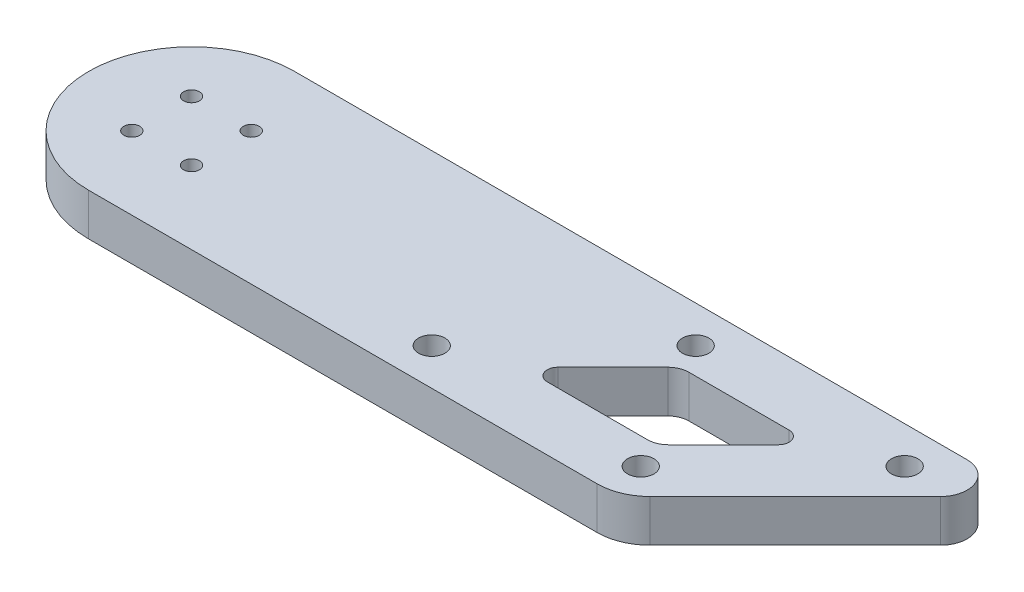
ISO-10303-21;
HEADER;
FILE_DESCRIPTION(('STEP AP214'),'2;1');
FILE_NAME('part.step','',(''),(''),'','','');
FILE_SCHEMA(('AUTOMOTIVE_DESIGN { 1 0 10303 214 1 1 1 1 }'));
ENDSEC;
DATA;
#1=APPLICATION_CONTEXT('core data for automotive mechanical design processes');
#2=APPLICATION_PROTOCOL_DEFINITION('international standard','automotive_design',2000,#1);
#3=PRODUCT_CONTEXT('',#1,'mechanical');
#4=PRODUCT('Part','Part','',(#3));
#5=PRODUCT_RELATED_PRODUCT_CATEGORY('part','',(#4));
#6=PRODUCT_DEFINITION_FORMATION('','',#4);
#7=PRODUCT_DEFINITION_CONTEXT('part definition',#1,'design');
#8=PRODUCT_DEFINITION('design','',#6,#7);
#9=PRODUCT_DEFINITION_SHAPE('','',#8);
#10=(LENGTH_UNIT() NAMED_UNIT(*) SI_UNIT(.MILLI.,.METRE.));
#11=(NAMED_UNIT(*) PLANE_ANGLE_UNIT() SI_UNIT($,.RADIAN.));
#12=(NAMED_UNIT(*) SI_UNIT($,.STERADIAN.) SOLID_ANGLE_UNIT());
#13=UNCERTAINTY_MEASURE_WITH_UNIT(LENGTH_MEASURE(1.E-05),#10,'distance_accuracy_value','');
#14=(GEOMETRIC_REPRESENTATION_CONTEXT(3) GLOBAL_UNCERTAINTY_ASSIGNED_CONTEXT((#13)) GLOBAL_UNIT_ASSIGNED_CONTEXT((#10,
#11,#12)) REPRESENTATION_CONTEXT('',''));
#15=CARTESIAN_POINT('',(0.,0.,0.));
#16=DIRECTION('',(0.,0.,1.));
#17=DIRECTION('',(1.,0.,0.));
#18=AXIS2_PLACEMENT_3D('',#15,#16,#17);
#19=CARTESIAN_POINT('',(0.,8.,0.));
#20=DIRECTION('',(0.,1.,0.));
#21=DIRECTION('',(0.,0.,1.));
#22=AXIS2_PLACEMENT_3D('',#19,#20,#21);
#23=PLANE('',#22);
#24=CARTESIAN_POINT('',(58.0025253169538,8.,12.5000000000058));
#25=DIRECTION('',(0.,1.,0.));
#26=DIRECTION('',(0.,0.,1.));
#27=AXIS2_PLACEMENT_3D('',#24,#25,#26);
#28=CIRCLE('',#27,2.5);
#29=CARTESIAN_POINT('',(58.0025253169538,8.,15.0000000000058));
#30=VERTEX_POINT('',#29);
#31=EDGE_CURVE('E465',#30,#30,#28,.T.);
#32=ORIENTED_EDGE('',*,*,#31,.F.);
#33=EDGE_LOOP('',(#32));
#34=FACE_BOUND('',#33,.T.);
#35=CARTESIAN_POINT('',(83.0025253169536,8.,-12.4999999999941));
#36=DIRECTION('',(0.,1.,0.));
#37=DIRECTION('',(0.,0.,1.));
#38=AXIS2_PLACEMENT_3D('',#35,#36,#37);
#39=CIRCLE('',#38,2.50000000000001);
#40=CARTESIAN_POINT('',(83.0025253169536,8.,-9.99999999999412));
#41=VERTEX_POINT('',#40);
#42=EDGE_CURVE('E486',#41,#41,#39,.T.);
#43=ORIENTED_EDGE('',*,*,#42,.F.);
#44=EDGE_LOOP('',(#43));
#45=FACE_BOUND('',#44,.T.);
#46=CARTESIAN_POINT('',(97.6005050634004,8.,12.5000000000057));
#47=DIRECTION('',(0.,1.,0.));
#48=DIRECTION('',(0.,0.,1.));
#49=AXIS2_PLACEMENT_3D('',#46,#47,#48);
#50=CIRCLE('',#49,2.50000000000001);
#51=CARTESIAN_POINT('',(97.6005050634004,8.,15.0000000000057));
#52=VERTEX_POINT('',#51);
#53=EDGE_CURVE('E473',#52,#52,#50,.T.);
#54=ORIENTED_EDGE('',*,*,#53,.F.);
#55=EDGE_LOOP('',(#54));
#56=FACE_BOUND('',#55,.T.);
#57=CARTESIAN_POINT('',(122.6005050634,8.,-12.4999999999942));
#58=DIRECTION('',(0.,1.,0.));
#59=DIRECTION('',(0.,0.,1.));
#60=AXIS2_PLACEMENT_3D('',#57,#58,#59);
#61=CIRCLE('',#60,2.49999999999999);
#62=CARTESIAN_POINT('',(122.6005050634,8.,-9.99999999999419));
#63=VERTEX_POINT('',#62);
#64=EDGE_CURVE('E469',#63,#63,#61,.T.);
#65=ORIENTED_EDGE('',*,*,#64,.F.);
#66=EDGE_LOOP('',(#65));
#67=FACE_BOUND('',#66,.T.);
#68=CARTESIAN_POINT('',(74.9020202535654,8.,5.50000000000585));
#69=DIRECTION('',(0.,1.,0.));
#70=DIRECTION('',(0.,0.,1.));
#71=AXIS2_PLACEMENT_3D('',#68,#69,#70);
#72=CIRCLE('',#71,2.);
#73=CARTESIAN_POINT('',(73.4878066911923,8.,4.08578643763276));
#74=VERTEX_POINT('',#73);
#75=CARTESIAN_POINT('',(74.9020202535654,8.,7.50000000000585));
#76=VERTEX_POINT('',#75);
#77=EDGE_CURVE('E39',#74,#76,#72,.T.);
#78=ORIENTED_EDGE('',*,*,#77,.F.);
#79=DIRECTION('',(-0.707106781186546,0.,0.707106781186549));
#80=VECTOR('',#79,1.);
#81=CARTESIAN_POINT('',(73.4878066911923,8.,4.08578643763276));
#82=LINE('',#81,#80);
#83=CARTESIAN_POINT('',(83.9020202535653,8.,-6.32842712474034));
#84=VERTEX_POINT('',#83);
#85=EDGE_CURVE('E94',#84,#74,#82,.T.);
#86=ORIENTED_EDGE('',*,*,#85,.F.);
#87=CARTESIAN_POINT('',(86.7304473783115,8.,-3.49999999999426));
#88=DIRECTION('',(0.,1.,0.));
#89=DIRECTION('',(0.,0.,1.));
#90=AXIS2_PLACEMENT_3D('',#87,#88,#89);
#91=CIRCLE('',#90,3.99999999999988);
#92=CARTESIAN_POINT('',(86.7304473783115,8.,-7.49999999999414));
#93=VERTEX_POINT('',#92);
#94=EDGE_CURVE('E195',#93,#84,#91,.T.);
#95=ORIENTED_EDGE('',*,*,#94,.F.);
#96=DIRECTION('',(-1.,0.,0.));
#97=VECTOR('',#96,1.);
#98=CARTESIAN_POINT('',(86.7304473783115,8.,-7.49999999999414));
#99=LINE('',#98,#97);
#100=CARTESIAN_POINT('',(105.701010126789,8.,-7.49999999999415));
#101=VERTEX_POINT('',#100);
#102=EDGE_CURVE('E193',#101,#93,#99,.T.);
#103=ORIENTED_EDGE('',*,*,#102,.F.);
#104=CARTESIAN_POINT('',(105.701010126789,8.,-5.49999999999414));
#105=DIRECTION('',(0.,1.,0.));
#106=DIRECTION('',(0.,0.,1.));
#107=AXIS2_PLACEMENT_3D('',#104,#105,#106);
#108=CIRCLE('',#107,2.00000000000001);
#109=CARTESIAN_POINT('',(107.115223689162,8.,-4.08578643762105));
#110=VERTEX_POINT('',#109);
#111=EDGE_CURVE('E191',#110,#101,#108,.T.);
#112=ORIENTED_EDGE('',*,*,#111,.F.);
#113=DIRECTION('',(0.707106781186547,0.,-0.707106781186548));
#114=VECTOR('',#113,1.);
#115=CARTESIAN_POINT('',(107.115223689162,8.,-4.08578643762105));
#116=LINE('',#115,#114);
#117=CARTESIAN_POINT('',(96.7010101267887,8.,6.32842712475201));
#118=VERTEX_POINT('',#117);
#119=EDGE_CURVE('E189',#118,#110,#116,.T.);
#120=ORIENTED_EDGE('',*,*,#119,.F.);
#121=CARTESIAN_POINT('',(93.8725830020424,8.,3.50000000000569));
#122=DIRECTION('',(0.,1.,0.));
#123=DIRECTION('',(0.,0.,1.));
#124=AXIS2_PLACEMENT_3D('',#121,#122,#123);
#125=CIRCLE('',#124,4.00000000000015);
#126=CARTESIAN_POINT('',(93.8725830020424,8.,7.50000000000585));
#127=VERTEX_POINT('',#126);
#128=EDGE_CURVE('E186',#127,#118,#125,.T.);
#129=ORIENTED_EDGE('',*,*,#128,.F.);
#130=DIRECTION('',(1.,0.,0.));
#131=VECTOR('',#130,1.);
#132=CARTESIAN_POINT('',(93.8725830020425,8.,7.50000000000585));
#133=LINE('',#132,#131);
#134=EDGE_CURVE('E184',#76,#127,#133,.T.);
#135=ORIENTED_EDGE('',*,*,#134,.F.);
#136=EDGE_LOOP('',(#78,#86,#95,#103,#112,#120,#129,#135));
#137=FACE_BOUND('',#136,.T.);
#138=CARTESIAN_POINT('',(5.65685424949238,8.,5.65685424949238));
#139=DIRECTION('',(0.,1.,0.));
#140=DIRECTION('',(0.,0.,1.));
#141=AXIS2_PLACEMENT_3D('',#138,#139,#140);
#142=CIRCLE('',#141,1.5);
#143=CARTESIAN_POINT('',(5.65685424949238,8.,7.15685424949238));
#144=VERTEX_POINT('',#143);
#145=EDGE_CURVE('E210',#144,#144,#142,.T.);
#146=ORIENTED_EDGE('',*,*,#145,.F.);
#147=EDGE_LOOP('',(#146));
#148=FACE_BOUND('',#147,.T.);
#149=CARTESIAN_POINT('',(-5.65685424949238,8.,-5.65685424949238));
#150=DIRECTION('',(0.,1.,0.));
#151=DIRECTION('',(0.,0.,1.));
#152=AXIS2_PLACEMENT_3D('',#149,#150,#151);
#153=CIRCLE('',#152,1.5);
#154=CARTESIAN_POINT('',(-5.65685424949238,8.,-4.15685424949238));
#155=VERTEX_POINT('',#154);
#156=EDGE_CURVE('E169',#155,#155,#153,.T.);
#157=ORIENTED_EDGE('',*,*,#156,.F.);
#158=EDGE_LOOP('',(#157));
#159=FACE_BOUND('',#158,.T.);
#160=CARTESIAN_POINT('',(0.,8.,0.));
#161=DIRECTION('',(0.,1.,0.));
#162=DIRECTION('',(0.,0.,1.));
#163=AXIS2_PLACEMENT_3D('',#160,#161,#162);
#164=CIRCLE('',#163,19.5);
#165=CARTESIAN_POINT('',(0.,8.,-19.5));
#166=VERTEX_POINT('',#165);
#167=CARTESIAN_POINT('',(0.,8.,19.5));
#168=VERTEX_POINT('',#167);
#169=EDGE_CURVE('E176',#166,#168,#164,.T.);
#170=ORIENTED_EDGE('',*,*,#169,.T.);
#171=DIRECTION('',(1.,0.,0.));
#172=VECTOR('',#171,1.);
#173=CARTESIAN_POINT('',(0.,8.,19.5));
#174=LINE('',#173,#172);
#175=CARTESIAN_POINT('',(96.3578643762689,8.,19.5));
#176=VERTEX_POINT('',#175);
#177=EDGE_CURVE('E133',#168,#176,#174,.T.);
#178=ORIENTED_EDGE('',*,*,#177,.T.);
#179=CARTESIAN_POINT('',(96.3578643762689,8.,9.5));
#180=DIRECTION('',(0.,1.,0.));
#181=DIRECTION('',(0.,0.,1.));
#182=AXIS2_PLACEMENT_3D('',#179,#180,#181);
#183=CIRCLE('',#182,10.);
#184=CARTESIAN_POINT('',(103.428932188134,8.,16.5710678118655));
#185=VERTEX_POINT('',#184);
#186=EDGE_CURVE('E228',#176,#185,#183,.T.);
#187=ORIENTED_EDGE('',*,*,#186,.T.);
#188=DIRECTION('',(0.707106781186551,0.,-0.707106781186544));
#189=VECTOR('',#188,1.);
#190=CARTESIAN_POINT('',(130.964466094067,8.,-10.9644660940672));
#191=LINE('',#190,#189);
#192=CARTESIAN_POINT('',(130.964466094067,8.,-10.9644660940672));
#193=VERTEX_POINT('',#192);
#194=EDGE_CURVE('E152',#185,#193,#191,.T.);
#195=ORIENTED_EDGE('',*,*,#194,.T.);
#196=CARTESIAN_POINT('',(127.428932188135,8.,-14.5));
#197=DIRECTION('',(0.,1.,0.));
#198=DIRECTION('',(0.,0.,-1.));
#199=AXIS2_PLACEMENT_3D('',#196,#197,#198);
#200=CIRCLE('',#199,5.);
#201=CARTESIAN_POINT('',(127.428932188135,8.,-19.5));
#202=VERTEX_POINT('',#201);
#203=EDGE_CURVE('E147',#193,#202,#200,.T.);
#204=ORIENTED_EDGE('',*,*,#203,.T.);
#205=DIRECTION('',(-1.,0.,0.));
#206=VECTOR('',#205,1.);
#207=CARTESIAN_POINT('',(0.,8.,-19.5));
#208=LINE('',#207,#206);
#209=EDGE_CURVE('E150',#202,#166,#208,.T.);
#210=ORIENTED_EDGE('',*,*,#209,.T.);
#211=EDGE_LOOP('',(#170,#178,#187,#195,#204,#210));
#212=FACE_BOUND('',#211,.T.);
#213=CARTESIAN_POINT('',(5.65685424949238,8.,-5.65685424949238));
#214=DIRECTION('',(0.,1.,0.));
#215=DIRECTION('',(0.,0.,1.));
#216=AXIS2_PLACEMENT_3D('',#213,#214,#215);
#217=CIRCLE('',#216,1.5);
#218=CARTESIAN_POINT('',(5.65685424949238,8.,-4.15685424949238));
#219=VERTEX_POINT('',#218);
#220=EDGE_CURVE('E216',#219,#219,#217,.T.);
#221=ORIENTED_EDGE('',*,*,#220,.F.);
#222=EDGE_LOOP('',(#221));
#223=FACE_BOUND('',#222,.T.);
#224=CARTESIAN_POINT('',(-5.65685424949238,8.,5.65685424949238));
#225=DIRECTION('',(0.,1.,0.));
#226=DIRECTION('',(0.,0.,1.));
#227=AXIS2_PLACEMENT_3D('',#224,#225,#226);
#228=CIRCLE('',#227,1.5);
#229=CARTESIAN_POINT('',(-5.65685424949238,8.,7.15685424949238));
#230=VERTEX_POINT('',#229);
#231=EDGE_CURVE('E201',#230,#230,#228,.T.);
#232=ORIENTED_EDGE('',*,*,#231,.F.);
#233=EDGE_LOOP('',(#232));
#234=FACE_BOUND('',#233,.T.);
#235=ADVANCED_FACE('F35',(#34,#45,#56,#67,#137,#148,#159,#212,#223,#234),#23,.T.);
#236=CARTESIAN_POINT('',(0.,0.,0.));
#237=DIRECTION('',(0.,1.,0.));
#238=DIRECTION('',(0.,0.,1.));
#239=AXIS2_PLACEMENT_3D('',#236,#237,#238);
#240=PLANE('',#239);
#241=CARTESIAN_POINT('',(58.0025253169538,0.,12.5000000000058));
#242=DIRECTION('',(0.,1.,0.));
#243=DIRECTION('',(0.,0.,1.));
#244=AXIS2_PLACEMENT_3D('',#241,#242,#243);
#245=CIRCLE('',#244,2.5);
#246=CARTESIAN_POINT('',(58.0025253169538,0.,15.0000000000058));
#247=VERTEX_POINT('',#246);
#248=EDGE_CURVE('E468',#247,#247,#245,.T.);
#249=ORIENTED_EDGE('',*,*,#248,.T.);
#250=EDGE_LOOP('',(#249));
#251=FACE_BOUND('',#250,.T.);
#252=CARTESIAN_POINT('',(83.0025253169536,0.,-12.4999999999941));
#253=DIRECTION('',(0.,1.,0.));
#254=DIRECTION('',(0.,0.,1.));
#255=AXIS2_PLACEMENT_3D('',#252,#253,#254);
#256=CIRCLE('',#255,2.50000000000001);
#257=CARTESIAN_POINT('',(83.0025253169536,0.,-9.99999999999412));
#258=VERTEX_POINT('',#257);
#259=EDGE_CURVE('E470',#258,#258,#256,.T.);
#260=ORIENTED_EDGE('',*,*,#259,.T.);
#261=EDGE_LOOP('',(#260));
#262=FACE_BOUND('',#261,.T.);
#263=CARTESIAN_POINT('',(97.6005050634004,0.,12.5000000000057));
#264=DIRECTION('',(0.,1.,0.));
#265=DIRECTION('',(0.,0.,1.));
#266=AXIS2_PLACEMENT_3D('',#263,#264,#265);
#267=CIRCLE('',#266,2.50000000000001);
#268=CARTESIAN_POINT('',(97.6005050634004,0.,15.0000000000057));
#269=VERTEX_POINT('',#268);
#270=EDGE_CURVE('E476',#269,#269,#267,.T.);
#271=ORIENTED_EDGE('',*,*,#270,.T.);
#272=EDGE_LOOP('',(#271));
#273=FACE_BOUND('',#272,.T.);
#274=CARTESIAN_POINT('',(122.6005050634,0.,-12.4999999999942));
#275=DIRECTION('',(0.,1.,0.));
#276=DIRECTION('',(0.,0.,1.));
#277=AXIS2_PLACEMENT_3D('',#274,#275,#276);
#278=CIRCLE('',#277,2.49999999999999);
#279=CARTESIAN_POINT('',(122.6005050634,0.,-9.99999999999419));
#280=VERTEX_POINT('',#279);
#281=EDGE_CURVE('E481',#280,#280,#278,.T.);
#282=ORIENTED_EDGE('',*,*,#281,.T.);
#283=EDGE_LOOP('',(#282));
#284=FACE_BOUND('',#283,.T.);
#285=DIRECTION('',(-0.707106781186546,0.,0.707106781186549));
#286=VECTOR('',#285,1.);
#287=CARTESIAN_POINT('',(73.4878066911923,0.,4.08578643763276));
#288=LINE('',#287,#286);
#289=CARTESIAN_POINT('',(83.9020202535653,0.,-6.32842712474032));
#290=VERTEX_POINT('',#289);
#291=CARTESIAN_POINT('',(73.4878066911923,0.,4.08578643763276));
#292=VERTEX_POINT('',#291);
#293=EDGE_CURVE('E509',#290,#292,#288,.T.);
#294=ORIENTED_EDGE('',*,*,#293,.T.);
#295=CARTESIAN_POINT('',(74.9020202535654,0.,5.50000000000585));
#296=DIRECTION('',(0.,1.,0.));
#297=DIRECTION('',(0.,0.,-1.));
#298=AXIS2_PLACEMENT_3D('',#295,#296,#297);
#299=CIRCLE('',#298,2.);
#300=CARTESIAN_POINT('',(74.9020202535654,0.,7.50000000000585));
#301=VERTEX_POINT('',#300);
#302=EDGE_CURVE('E490',#292,#301,#299,.T.);
#303=ORIENTED_EDGE('',*,*,#302,.T.);
#304=DIRECTION('',(1.,0.,0.));
#305=VECTOR('',#304,1.);
#306=CARTESIAN_POINT('',(93.8725830020425,0.,7.50000000000585));
#307=LINE('',#306,#305);
#308=CARTESIAN_POINT('',(93.8725830020425,0.,7.50000000000585));
#309=VERTEX_POINT('',#308);
#310=EDGE_CURVE('E493',#301,#309,#307,.T.);
#311=ORIENTED_EDGE('',*,*,#310,.T.);
#312=CARTESIAN_POINT('',(93.8725830020424,0.,3.50000000000569));
#313=DIRECTION('',(0.,1.,0.));
#314=DIRECTION('',(0.,0.,1.));
#315=AXIS2_PLACEMENT_3D('',#312,#313,#314);
#316=CIRCLE('',#315,4.00000000000015);
#317=CARTESIAN_POINT('',(96.7010101267887,0.,6.32842712475204));
#318=VERTEX_POINT('',#317);
#319=EDGE_CURVE('E61',#309,#318,#316,.T.);
#320=ORIENTED_EDGE('',*,*,#319,.T.);
#321=DIRECTION('',(0.707106781186547,0.,-0.707106781186548));
#322=VECTOR('',#321,1.);
#323=CARTESIAN_POINT('',(107.115223689162,0.,-4.08578643762105));
#324=LINE('',#323,#322);
#325=CARTESIAN_POINT('',(107.115223689162,0.,-4.08578643762105));
#326=VERTEX_POINT('',#325);
#327=EDGE_CURVE('E497',#318,#326,#324,.T.);
#328=ORIENTED_EDGE('',*,*,#327,.T.);
#329=CARTESIAN_POINT('',(105.701010126789,0.,-5.49999999999414));
#330=DIRECTION('',(0.,1.,0.));
#331=DIRECTION('',(0.,0.,1.));
#332=AXIS2_PLACEMENT_3D('',#329,#330,#331);
#333=CIRCLE('',#332,2.00000000000001);
#334=CARTESIAN_POINT('',(105.701010126789,0.,-7.49999999999415));
#335=VERTEX_POINT('',#334);
#336=EDGE_CURVE('E500',#326,#335,#333,.T.);
#337=ORIENTED_EDGE('',*,*,#336,.T.);
#338=DIRECTION('',(-1.,0.,0.));
#339=VECTOR('',#338,1.);
#340=CARTESIAN_POINT('',(86.7304473783115,0.,-7.49999999999414));
#341=LINE('',#340,#339);
#342=CARTESIAN_POINT('',(86.7304473783115,0.,-7.49999999999414));
#343=VERTEX_POINT('',#342);
#344=EDGE_CURVE('E503',#335,#343,#341,.T.);
#345=ORIENTED_EDGE('',*,*,#344,.T.);
#346=CARTESIAN_POINT('',(86.7304473783115,0.,-3.49999999999426));
#347=DIRECTION('',(0.,1.,0.));
#348=DIRECTION('',(0.,0.,1.));
#349=AXIS2_PLACEMENT_3D('',#346,#347,#348);
#350=CIRCLE('',#349,3.99999999999988);
#351=EDGE_CURVE('E506',#343,#290,#350,.T.);
#352=ORIENTED_EDGE('',*,*,#351,.T.);
#353=EDGE_LOOP('',(#294,#303,#311,#320,#328,#337,#345,#352));
#354=FACE_BOUND('',#353,.T.);
#355=CARTESIAN_POINT('',(0.,0.,0.));
#356=DIRECTION('',(0.,1.,0.));
#357=DIRECTION('',(0.,0.,1.));
#358=AXIS2_PLACEMENT_3D('',#355,#356,#357);
#359=CIRCLE('',#358,19.5);
#360=CARTESIAN_POINT('',(0.,0.,-19.5));
#361=VERTEX_POINT('',#360);
#362=CARTESIAN_POINT('',(0.,0.,19.5));
#363=VERTEX_POINT('',#362);
#364=EDGE_CURVE('E166',#361,#363,#359,.T.);
#365=ORIENTED_EDGE('',*,*,#364,.F.);
#366=DIRECTION('',(-1.,0.,0.));
#367=VECTOR('',#366,1.);
#368=CARTESIAN_POINT('',(0.,0.,-19.5));
#369=LINE('',#368,#367);
#370=CARTESIAN_POINT('',(127.428932188135,0.,-19.5));
#371=VERTEX_POINT('',#370);
#372=EDGE_CURVE('E125',#371,#361,#369,.T.);
#373=ORIENTED_EDGE('',*,*,#372,.F.);
#374=CARTESIAN_POINT('',(127.428932188135,0.,-14.5));
#375=DIRECTION('',(0.,1.,0.));
#376=DIRECTION('',(0.,0.,-1.));
#377=AXIS2_PLACEMENT_3D('',#374,#375,#376);
#378=CIRCLE('',#377,5.);
#379=CARTESIAN_POINT('',(130.964466094067,0.,-10.9644660940672));
#380=VERTEX_POINT('',#379);
#381=EDGE_CURVE('E118',#380,#371,#378,.T.);
#382=ORIENTED_EDGE('',*,*,#381,.F.);
#383=DIRECTION('',(0.707106781186551,0.,-0.707106781186544));
#384=VECTOR('',#383,1.);
#385=CARTESIAN_POINT('',(130.964466094067,0.,-10.9644660940672));
#386=LINE('',#385,#384);
#387=CARTESIAN_POINT('',(103.428932188134,0.,16.5710678118655));
#388=VERTEX_POINT('',#387);
#389=EDGE_CURVE('E173',#388,#380,#386,.T.);
#390=ORIENTED_EDGE('',*,*,#389,.F.);
#391=CARTESIAN_POINT('',(96.3578643762689,0.,9.5));
#392=DIRECTION('',(0.,1.,0.));
#393=DIRECTION('',(0.,0.,1.));
#394=AXIS2_PLACEMENT_3D('',#391,#392,#393);
#395=CIRCLE('',#394,10.);
#396=CARTESIAN_POINT('',(96.3578643762689,0.,19.5));
#397=VERTEX_POINT('',#396);
#398=EDGE_CURVE('E171',#397,#388,#395,.T.);
#399=ORIENTED_EDGE('',*,*,#398,.F.);
#400=DIRECTION('',(1.,0.,0.));
#401=VECTOR('',#400,1.);
#402=CARTESIAN_POINT('',(0.,0.,19.5));
#403=LINE('',#402,#401);
#404=EDGE_CURVE('E103',#363,#397,#403,.T.);
#405=ORIENTED_EDGE('',*,*,#404,.F.);
#406=EDGE_LOOP('',(#365,#373,#382,#390,#399,#405));
#407=FACE_BOUND('',#406,.T.);
#408=CARTESIAN_POINT('',(-5.65685424949238,0.,-5.65685424949238));
#409=DIRECTION('',(0.,1.,0.));
#410=DIRECTION('',(0.,0.,1.));
#411=AXIS2_PLACEMENT_3D('',#408,#409,#410);
#412=CIRCLE('',#411,1.5);
#413=CARTESIAN_POINT('',(-5.65685424949238,0.,-4.15685424949238));
#414=VERTEX_POINT('',#413);
#415=EDGE_CURVE('E219',#414,#414,#412,.T.);
#416=ORIENTED_EDGE('',*,*,#415,.T.);
#417=EDGE_LOOP('',(#416));
#418=FACE_BOUND('',#417,.T.);
#419=CARTESIAN_POINT('',(5.65685424949238,0.,-5.65685424949238));
#420=DIRECTION('',(0.,1.,0.));
#421=DIRECTION('',(0.,0.,1.));
#422=AXIS2_PLACEMENT_3D('',#419,#420,#421);
#423=CIRCLE('',#422,1.5);
#424=CARTESIAN_POINT('',(5.65685424949238,0.,-4.15685424949238));
#425=VERTEX_POINT('',#424);
#426=EDGE_CURVE('E213',#425,#425,#423,.T.);
#427=ORIENTED_EDGE('',*,*,#426,.T.);
#428=EDGE_LOOP('',(#427));
#429=FACE_BOUND('',#428,.T.);
#430=CARTESIAN_POINT('',(5.65685424949238,0.,5.65685424949238));
#431=DIRECTION('',(0.,1.,0.));
#432=DIRECTION('',(0.,0.,1.));
#433=AXIS2_PLACEMENT_3D('',#430,#431,#432);
#434=CIRCLE('',#433,1.5);
#435=CARTESIAN_POINT('',(5.65685424949238,0.,7.15685424949238));
#436=VERTEX_POINT('',#435);
#437=EDGE_CURVE('E206',#436,#436,#434,.T.);
#438=ORIENTED_EDGE('',*,*,#437,.T.);
#439=EDGE_LOOP('',(#438));
#440=FACE_BOUND('',#439,.T.);
#441=CARTESIAN_POINT('',(-5.65685424949238,0.,5.65685424949238));
#442=DIRECTION('',(0.,1.,0.));
#443=DIRECTION('',(0.,0.,1.));
#444=AXIS2_PLACEMENT_3D('',#441,#442,#443);
#445=CIRCLE('',#444,1.5);
#446=CARTESIAN_POINT('',(-5.65685424949238,0.,7.15685424949238));
#447=VERTEX_POINT('',#446);
#448=EDGE_CURVE('E196',#447,#447,#445,.T.);
#449=ORIENTED_EDGE('',*,*,#448,.T.);
#450=EDGE_LOOP('',(#449));
#451=FACE_BOUND('',#450,.T.);
#452=ADVANCED_FACE('F236',(#251,#262,#273,#284,#354,#407,#418,#429,#440,#451),#240,.F.);
#453=CARTESIAN_POINT('',(0.,8.,0.));
#454=DIRECTION('',(0.,-1.,0.));
#455=DIRECTION('',(0.,0.,-1.));
#456=AXIS2_PLACEMENT_3D('',#453,#454,#455);
#457=CYLINDRICAL_SURFACE('',#456,19.5);
#458=ORIENTED_EDGE('',*,*,#364,.T.);
#459=DIRECTION('',(0.,-1.,0.));
#460=VECTOR('',#459,1.);
#461=CARTESIAN_POINT('',(0.,8.,19.5));
#462=LINE('',#461,#460);
#463=EDGE_CURVE('E11',#168,#363,#462,.T.);
#464=ORIENTED_EDGE('',*,*,#463,.F.);
#465=ORIENTED_EDGE('',*,*,#169,.F.);
#466=DIRECTION('',(0.,-1.,0.));
#467=VECTOR('',#466,1.);
#468=CARTESIAN_POINT('',(0.,8.,-19.5));
#469=LINE('',#468,#467);
#470=EDGE_CURVE('E158',#166,#361,#469,.T.);
#471=ORIENTED_EDGE('',*,*,#470,.T.);
#472=EDGE_LOOP('',(#458,#464,#465,#471));
#473=FACE_BOUND('',#472,.T.);
#474=ADVANCED_FACE('F37',(#473),#457,.T.);
#475=CARTESIAN_POINT('',(0.,8.,19.5));
#476=DIRECTION('',(0.,0.,-1.));
#477=DIRECTION('',(-1.,0.,0.));
#478=AXIS2_PLACEMENT_3D('',#475,#476,#477);
#479=PLANE('',#478);
#480=ORIENTED_EDGE('',*,*,#404,.T.);
#481=DIRECTION('',(0.,-1.,0.));
#482=VECTOR('',#481,1.);
#483=CARTESIAN_POINT('',(96.3578643762689,8.,19.5));
#484=LINE('',#483,#482);
#485=EDGE_CURVE('E44',#176,#397,#484,.T.);
#486=ORIENTED_EDGE('',*,*,#485,.F.);
#487=ORIENTED_EDGE('',*,*,#177,.F.);
#488=ORIENTED_EDGE('',*,*,#463,.T.);
#489=EDGE_LOOP('',(#480,#486,#487,#488));
#490=FACE_BOUND('',#489,.T.);
#491=ADVANCED_FACE('F240',(#490),#479,.F.);
#492=CARTESIAN_POINT('',(96.3578643762689,8.,9.5));
#493=DIRECTION('',(0.,-1.,0.));
#494=DIRECTION('',(0.,0.,-1.));
#495=AXIS2_PLACEMENT_3D('',#492,#493,#494);
#496=CYLINDRICAL_SURFACE('',#495,10.);
#497=ORIENTED_EDGE('',*,*,#398,.T.);
#498=DIRECTION('',(0.,-1.,0.));
#499=VECTOR('',#498,1.);
#500=CARTESIAN_POINT('',(103.428932188134,8.,16.5710678118655));
#501=LINE('',#500,#499);
#502=EDGE_CURVE('E179',#185,#388,#501,.T.);
#503=ORIENTED_EDGE('',*,*,#502,.F.);
#504=ORIENTED_EDGE('',*,*,#186,.F.);
#505=ORIENTED_EDGE('',*,*,#485,.T.);
#506=EDGE_LOOP('',(#497,#503,#504,#505));
#507=FACE_BOUND('',#506,.T.);
#508=ADVANCED_FACE('F232',(#507),#496,.T.);
#509=CARTESIAN_POINT('',(130.964466094067,8.,-10.9644660940672));
#510=DIRECTION('',(-0.707106781186544,0.,-0.707106781186551));
#511=DIRECTION('',(-0.707106781186551,0.,0.707106781186544));
#512=AXIS2_PLACEMENT_3D('',#509,#510,#511);
#513=PLANE('',#512);
#514=ORIENTED_EDGE('',*,*,#389,.T.);
#515=DIRECTION('',(0.,-1.,0.));
#516=VECTOR('',#515,1.);
#517=CARTESIAN_POINT('',(130.964466094067,8.,-10.9644660940672));
#518=LINE('',#517,#516);
#519=EDGE_CURVE('E157',#193,#380,#518,.T.);
#520=ORIENTED_EDGE('',*,*,#519,.F.);
#521=ORIENTED_EDGE('',*,*,#194,.F.);
#522=ORIENTED_EDGE('',*,*,#502,.T.);
#523=EDGE_LOOP('',(#514,#520,#521,#522));
#524=FACE_BOUND('',#523,.T.);
#525=ADVANCED_FACE('F235',(#524),#513,.F.);
#526=CARTESIAN_POINT('',(127.428932188135,8.,-14.5));
#527=DIRECTION('',(0.,-1.,0.));
#528=DIRECTION('',(0.,0.,-1.));
#529=AXIS2_PLACEMENT_3D('',#526,#527,#528);
#530=CYLINDRICAL_SURFACE('',#529,5.);
#531=ORIENTED_EDGE('',*,*,#381,.T.);
#532=DIRECTION('',(0.,-1.,0.));
#533=VECTOR('',#532,1.);
#534=CARTESIAN_POINT('',(127.428932188135,8.,-19.5));
#535=LINE('',#534,#533);
#536=EDGE_CURVE('E155',#202,#371,#535,.T.);
#537=ORIENTED_EDGE('',*,*,#536,.F.);
#538=ORIENTED_EDGE('',*,*,#203,.F.);
#539=ORIENTED_EDGE('',*,*,#519,.T.);
#540=EDGE_LOOP('',(#531,#537,#538,#539));
#541=FACE_BOUND('',#540,.T.);
#542=ADVANCED_FACE('F156',(#541),#530,.T.);
#543=CARTESIAN_POINT('',(0.,8.,-19.5));
#544=DIRECTION('',(0.,0.,1.));
#545=DIRECTION('',(1.,0.,0.));
#546=AXIS2_PLACEMENT_3D('',#543,#544,#545);
#547=PLANE('',#546);
#548=ORIENTED_EDGE('',*,*,#372,.T.);
#549=ORIENTED_EDGE('',*,*,#470,.F.);
#550=ORIENTED_EDGE('',*,*,#209,.F.);
#551=ORIENTED_EDGE('',*,*,#536,.T.);
#552=EDGE_LOOP('',(#548,#549,#550,#551));
#553=FACE_BOUND('',#552,.T.);
#554=ADVANCED_FACE('F160',(#553),#547,.F.);
#555=CARTESIAN_POINT('',(-5.65685424949238,8.,-5.65685424949238));
#556=DIRECTION('',(0.,-1.,0.));
#557=DIRECTION('',(0.,0.,-1.));
#558=AXIS2_PLACEMENT_3D('',#555,#556,#557);
#559=CYLINDRICAL_SURFACE('',#558,1.5);
#560=ORIENTED_EDGE('',*,*,#156,.T.);
#561=EDGE_LOOP('',(#560));
#562=FACE_BOUND('',#561,.T.);
#563=ORIENTED_EDGE('',*,*,#415,.F.);
#564=EDGE_LOOP('',(#563));
#565=FACE_BOUND('',#564,.T.);
#566=ADVANCED_FACE('F259',(#562,#565),#559,.F.);
#567=CARTESIAN_POINT('',(5.65685424949238,8.,-5.65685424949238));
#568=DIRECTION('',(0.,-1.,0.));
#569=DIRECTION('',(0.,0.,-1.));
#570=AXIS2_PLACEMENT_3D('',#567,#568,#569);
#571=CYLINDRICAL_SURFACE('',#570,1.5);
#572=ORIENTED_EDGE('',*,*,#220,.T.);
#573=EDGE_LOOP('',(#572));
#574=FACE_BOUND('',#573,.T.);
#575=ORIENTED_EDGE('',*,*,#426,.F.);
#576=EDGE_LOOP('',(#575));
#577=FACE_BOUND('',#576,.T.);
#578=ADVANCED_FACE('F285',(#574,#577),#571,.F.);
#579=CARTESIAN_POINT('',(5.65685424949238,8.,5.65685424949238));
#580=DIRECTION('',(0.,-1.,0.));
#581=DIRECTION('',(0.,0.,-1.));
#582=AXIS2_PLACEMENT_3D('',#579,#580,#581);
#583=CYLINDRICAL_SURFACE('',#582,1.5);
#584=ORIENTED_EDGE('',*,*,#145,.T.);
#585=EDGE_LOOP('',(#584));
#586=FACE_BOUND('',#585,.T.);
#587=ORIENTED_EDGE('',*,*,#437,.F.);
#588=EDGE_LOOP('',(#587));
#589=FACE_BOUND('',#588,.T.);
#590=ADVANCED_FACE('F292',(#586,#589),#583,.F.);
#591=CARTESIAN_POINT('',(-5.65685424949238,8.,5.65685424949238));
#592=DIRECTION('',(0.,-1.,0.));
#593=DIRECTION('',(0.,0.,-1.));
#594=AXIS2_PLACEMENT_3D('',#591,#592,#593);
#595=CYLINDRICAL_SURFACE('',#594,1.5);
#596=ORIENTED_EDGE('',*,*,#231,.T.);
#597=EDGE_LOOP('',(#596));
#598=FACE_BOUND('',#597,.T.);
#599=ORIENTED_EDGE('',*,*,#448,.F.);
#600=EDGE_LOOP('',(#599));
#601=FACE_BOUND('',#600,.T.);
#602=ADVANCED_FACE('F299',(#598,#601),#595,.F.);
#603=CARTESIAN_POINT('',(74.9020202535654,0.,5.50000000000585));
#604=DIRECTION('',(0.,1.,0.));
#605=DIRECTION('',(0.,0.,1.));
#606=AXIS2_PLACEMENT_3D('',#603,#604,#605);
#607=CYLINDRICAL_SURFACE('',#606,2.);
#608=ORIENTED_EDGE('',*,*,#77,.T.);
#609=DIRECTION('',(0.,1.,0.));
#610=VECTOR('',#609,1.);
#611=CARTESIAN_POINT('',(74.9020202535654,0.,7.50000000000585));
#612=LINE('',#611,#610);
#613=EDGE_CURVE('E52',#301,#76,#612,.T.);
#614=ORIENTED_EDGE('',*,*,#613,.F.);
#615=ORIENTED_EDGE('',*,*,#302,.F.);
#616=DIRECTION('',(0.,1.,0.));
#617=VECTOR('',#616,1.);
#618=CARTESIAN_POINT('',(73.4878066911923,0.,4.08578643763276));
#619=LINE('',#618,#617);
#620=EDGE_CURVE('E187',#292,#74,#619,.T.);
#621=ORIENTED_EDGE('',*,*,#620,.T.);
#622=EDGE_LOOP('',(#608,#614,#615,#621));
#623=FACE_BOUND('',#622,.T.);
#624=ADVANCED_FACE('F307',(#623),#607,.F.);
#625=CARTESIAN_POINT('',(73.4878066911923,0.,4.08578643763276));
#626=DIRECTION('',(-0.707106781186549,0.,-0.707106781186546));
#627=DIRECTION('',(-0.707106781186546,0.,0.707106781186549));
#628=AXIS2_PLACEMENT_3D('',#625,#626,#627);
#629=PLANE('',#628);
#630=ORIENTED_EDGE('',*,*,#85,.T.);
#631=ORIENTED_EDGE('',*,*,#620,.F.);
#632=ORIENTED_EDGE('',*,*,#293,.F.);
#633=DIRECTION('',(0.,1.,0.));
#634=VECTOR('',#633,1.);
#635=CARTESIAN_POINT('',(83.9020202535653,0.,-6.32842712474032));
#636=LINE('',#635,#634);
#637=EDGE_CURVE('E512',#290,#84,#636,.T.);
#638=ORIENTED_EDGE('',*,*,#637,.T.);
#639=EDGE_LOOP('',(#630,#631,#632,#638));
#640=FACE_BOUND('',#639,.T.);
#641=ADVANCED_FACE('F315',(#640),#629,.F.);
#642=CARTESIAN_POINT('',(86.7304473783115,0.,-3.49999999999426));
#643=DIRECTION('',(0.,1.,0.));
#644=DIRECTION('',(0.,0.,1.));
#645=AXIS2_PLACEMENT_3D('',#642,#643,#644);
#646=CYLINDRICAL_SURFACE('',#645,3.99999999999988);
#647=ORIENTED_EDGE('',*,*,#94,.T.);
#648=ORIENTED_EDGE('',*,*,#637,.F.);
#649=ORIENTED_EDGE('',*,*,#351,.F.);
#650=DIRECTION('',(0.,1.,0.));
#651=VECTOR('',#650,1.);
#652=CARTESIAN_POINT('',(86.7304473783115,0.,-7.49999999999414));
#653=LINE('',#652,#651);
#654=EDGE_CURVE('E514',#343,#93,#653,.T.);
#655=ORIENTED_EDGE('',*,*,#654,.T.);
#656=EDGE_LOOP('',(#647,#648,#649,#655));
#657=FACE_BOUND('',#656,.T.);
#658=ADVANCED_FACE('F322',(#657),#646,.F.);
#659=CARTESIAN_POINT('',(86.7304473783115,0.,-7.49999999999414));
#660=DIRECTION('',(0.,0.,-1.));
#661=DIRECTION('',(-1.,0.,0.));
#662=AXIS2_PLACEMENT_3D('',#659,#660,#661);
#663=PLANE('',#662);
#664=ORIENTED_EDGE('',*,*,#102,.T.);
#665=ORIENTED_EDGE('',*,*,#654,.F.);
#666=ORIENTED_EDGE('',*,*,#344,.F.);
#667=DIRECTION('',(0.,1.,0.));
#668=VECTOR('',#667,1.);
#669=CARTESIAN_POINT('',(105.701010126789,0.,-7.49999999999415));
#670=LINE('',#669,#668);
#671=EDGE_CURVE('E520',#335,#101,#670,.T.);
#672=ORIENTED_EDGE('',*,*,#671,.T.);
#673=EDGE_LOOP('',(#664,#665,#666,#672));
#674=FACE_BOUND('',#673,.T.);
#675=ADVANCED_FACE('F329',(#674),#663,.F.);
#676=CARTESIAN_POINT('',(105.701010126789,0.,-5.49999999999414));
#677=DIRECTION('',(0.,1.,0.));
#678=DIRECTION('',(0.,0.,1.));
#679=AXIS2_PLACEMENT_3D('',#676,#677,#678);
#680=CYLINDRICAL_SURFACE('',#679,2.00000000000001);
#681=ORIENTED_EDGE('',*,*,#111,.T.);
#682=ORIENTED_EDGE('',*,*,#671,.F.);
#683=ORIENTED_EDGE('',*,*,#336,.F.);
#684=DIRECTION('',(0.,1.,0.));
#685=VECTOR('',#684,1.);
#686=CARTESIAN_POINT('',(107.115223689162,0.,-4.08578643762105));
#687=LINE('',#686,#685);
#688=EDGE_CURVE('E523',#326,#110,#687,.T.);
#689=ORIENTED_EDGE('',*,*,#688,.T.);
#690=EDGE_LOOP('',(#681,#682,#683,#689));
#691=FACE_BOUND('',#690,.T.);
#692=ADVANCED_FACE('F337',(#691),#680,.F.);
#693=CARTESIAN_POINT('',(107.115223689162,0.,-4.08578643762105));
#694=DIRECTION('',(0.707106781186548,0.,0.707106781186547));
#695=DIRECTION('',(0.707106781186547,0.,-0.707106781186548));
#696=AXIS2_PLACEMENT_3D('',#693,#694,#695);
#697=PLANE('',#696);
#698=ORIENTED_EDGE('',*,*,#119,.T.);
#699=ORIENTED_EDGE('',*,*,#688,.F.);
#700=ORIENTED_EDGE('',*,*,#327,.F.);
#701=DIRECTION('',(0.,1.,0.));
#702=VECTOR('',#701,1.);
#703=CARTESIAN_POINT('',(96.7010101267887,0.,6.32842712475204));
#704=LINE('',#703,#702);
#705=EDGE_CURVE('E526',#318,#118,#704,.T.);
#706=ORIENTED_EDGE('',*,*,#705,.T.);
#707=EDGE_LOOP('',(#698,#699,#700,#706));
#708=FACE_BOUND('',#707,.T.);
#709=ADVANCED_FACE('F345',(#708),#697,.F.);
#710=CARTESIAN_POINT('',(93.8725830020424,0.,3.50000000000569));
#711=DIRECTION('',(0.,1.,0.));
#712=DIRECTION('',(0.,0.,1.));
#713=AXIS2_PLACEMENT_3D('',#710,#711,#712);
#714=CYLINDRICAL_SURFACE('',#713,4.00000000000015);
#715=ORIENTED_EDGE('',*,*,#128,.T.);
#716=ORIENTED_EDGE('',*,*,#705,.F.);
#717=ORIENTED_EDGE('',*,*,#319,.F.);
#718=DIRECTION('',(0.,1.,0.));
#719=VECTOR('',#718,1.);
#720=CARTESIAN_POINT('',(93.8725830020425,0.,7.50000000000585));
#721=LINE('',#720,#719);
#722=EDGE_CURVE('E517',#309,#127,#721,.T.);
#723=ORIENTED_EDGE('',*,*,#722,.T.);
#724=EDGE_LOOP('',(#715,#716,#717,#723));
#725=FACE_BOUND('',#724,.T.);
#726=ADVANCED_FACE('F353',(#725),#714,.F.);
#727=CARTESIAN_POINT('',(93.8725830020425,0.,7.50000000000585));
#728=DIRECTION('',(0.,0.,1.));
#729=DIRECTION('',(1.,0.,0.));
#730=AXIS2_PLACEMENT_3D('',#727,#728,#729);
#731=PLANE('',#730);
#732=ORIENTED_EDGE('',*,*,#134,.T.);
#733=ORIENTED_EDGE('',*,*,#722,.F.);
#734=ORIENTED_EDGE('',*,*,#310,.F.);
#735=ORIENTED_EDGE('',*,*,#613,.T.);
#736=EDGE_LOOP('',(#732,#733,#734,#735));
#737=FACE_BOUND('',#736,.T.);
#738=ADVANCED_FACE('F361',(#737),#731,.F.);
#739=CARTESIAN_POINT('',(122.6005050634,0.,-12.4999999999942));
#740=DIRECTION('',(0.,1.,0.));
#741=DIRECTION('',(0.,0.,1.));
#742=AXIS2_PLACEMENT_3D('',#739,#740,#741);
#743=CYLINDRICAL_SURFACE('',#742,2.49999999999999);
#744=ORIENTED_EDGE('',*,*,#64,.T.);
#745=EDGE_LOOP('',(#744));
#746=FACE_BOUND('',#745,.T.);
#747=ORIENTED_EDGE('',*,*,#281,.F.);
#748=EDGE_LOOP('',(#747));
#749=FACE_BOUND('',#748,.T.);
#750=ADVANCED_FACE('F367',(#746,#749),#743,.F.);
#751=CARTESIAN_POINT('',(97.6005050634004,0.,12.5000000000057));
#752=DIRECTION('',(0.,1.,0.));
#753=DIRECTION('',(0.,0.,1.));
#754=AXIS2_PLACEMENT_3D('',#751,#752,#753);
#755=CYLINDRICAL_SURFACE('',#754,2.50000000000001);
#756=ORIENTED_EDGE('',*,*,#53,.T.);
#757=EDGE_LOOP('',(#756));
#758=FACE_BOUND('',#757,.T.);
#759=ORIENTED_EDGE('',*,*,#270,.F.);
#760=EDGE_LOOP('',(#759));
#761=FACE_BOUND('',#760,.T.);
#762=ADVANCED_FACE('F374',(#758,#761),#755,.F.);
#763=CARTESIAN_POINT('',(83.0025253169536,0.,-12.4999999999941));
#764=DIRECTION('',(0.,1.,0.));
#765=DIRECTION('',(0.,0.,1.));
#766=AXIS2_PLACEMENT_3D('',#763,#764,#765);
#767=CYLINDRICAL_SURFACE('',#766,2.50000000000001);
#768=ORIENTED_EDGE('',*,*,#42,.T.);
#769=EDGE_LOOP('',(#768));
#770=FACE_BOUND('',#769,.T.);
#771=ORIENTED_EDGE('',*,*,#259,.F.);
#772=EDGE_LOOP('',(#771));
#773=FACE_BOUND('',#772,.T.);
#774=ADVANCED_FACE('F382',(#770,#773),#767,.F.);
#775=CARTESIAN_POINT('',(58.0025253169538,0.,12.5000000000058));
#776=DIRECTION('',(0.,1.,0.));
#777=DIRECTION('',(0.,0.,1.));
#778=AXIS2_PLACEMENT_3D('',#775,#776,#777);
#779=CYLINDRICAL_SURFACE('',#778,2.5);
#780=ORIENTED_EDGE('',*,*,#31,.T.);
#781=EDGE_LOOP('',(#780));
#782=FACE_BOUND('',#781,.T.);
#783=ORIENTED_EDGE('',*,*,#248,.F.);
#784=EDGE_LOOP('',(#783));
#785=FACE_BOUND('',#784,.T.);
#786=ADVANCED_FACE('F390',(#782,#785),#779,.F.);
#787=CLOSED_SHELL('',(#235,#452,#474,#491,#508,#525,#542,#554,#566,#578,#590,#602,#624,#641,
#658,#675,#692,#709,#726,#738,#750,#762,#774,#786));
#788=MANIFOLD_SOLID_BREP('B2',#787);
#789=ADVANCED_BREP_SHAPE_REPRESENTATION('',(#18,#788),#14);
#790=SHAPE_DEFINITION_REPRESENTATION(#9,#789);
ENDSEC;
END-ISO-10303-21;
